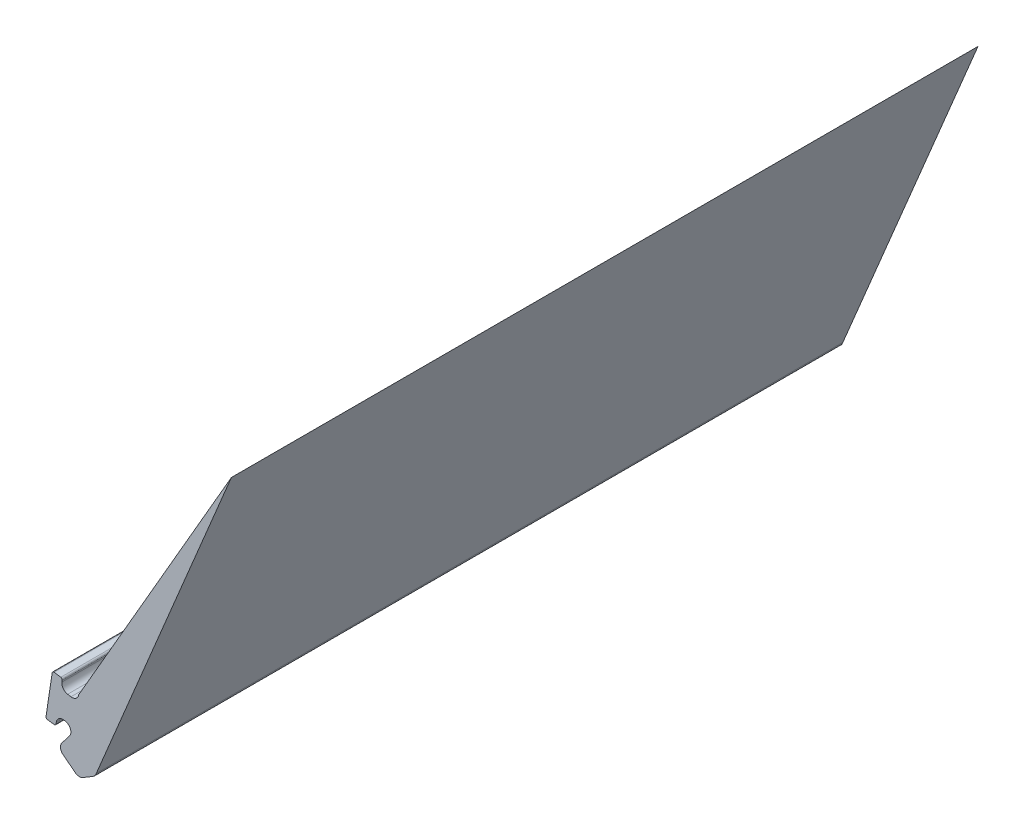
ISO-10303-21;
HEADER;
FILE_DESCRIPTION(('STEP AP214'),'2;1');
FILE_NAME('part.step','',(''),(''),'','','');
FILE_SCHEMA(('AUTOMOTIVE_DESIGN { 1 0 10303 214 1 1 1 1 }'));
ENDSEC;
DATA;
#1=APPLICATION_CONTEXT('core data for automotive mechanical design processes');
#2=APPLICATION_PROTOCOL_DEFINITION('international standard','automotive_design',2000,#1);
#3=PRODUCT_CONTEXT('',#1,'mechanical');
#4=PRODUCT('Part','Part','',(#3));
#5=PRODUCT_RELATED_PRODUCT_CATEGORY('part','',(#4));
#6=PRODUCT_DEFINITION_FORMATION('','',#4);
#7=PRODUCT_DEFINITION_CONTEXT('part definition',#1,'design');
#8=PRODUCT_DEFINITION('design','',#6,#7);
#9=PRODUCT_DEFINITION_SHAPE('','',#8);
#10=(LENGTH_UNIT() NAMED_UNIT(*) SI_UNIT(.MILLI.,.METRE.));
#11=(NAMED_UNIT(*) PLANE_ANGLE_UNIT() SI_UNIT($,.RADIAN.));
#12=(NAMED_UNIT(*) SI_UNIT($,.STERADIAN.) SOLID_ANGLE_UNIT());
#13=UNCERTAINTY_MEASURE_WITH_UNIT(LENGTH_MEASURE(1.E-05),#10,'distance_accuracy_value','');
#14=(GEOMETRIC_REPRESENTATION_CONTEXT(3) GLOBAL_UNCERTAINTY_ASSIGNED_CONTEXT((#13)) GLOBAL_UNIT_ASSIGNED_CONTEXT((#10,
#11,#12)) REPRESENTATION_CONTEXT('',''));
#15=CARTESIAN_POINT('',(0.,0.,0.));
#16=DIRECTION('',(0.,0.,1.));
#17=DIRECTION('',(1.,0.,0.));
#18=AXIS2_PLACEMENT_3D('',#15,#16,#17);
#19=CARTESIAN_POINT('',(-22.585447148469,11.7939049154633,-22.));
#20=DIRECTION('',(0.,0.,1.));
#21=DIRECTION('',(1.,0.,0.));
#22=AXIS2_PLACEMENT_3D('',#19,#20,#21);
#23=CYLINDRICAL_SURFACE('',#22,0.0499999999999998);
#24=CARTESIAN_POINT('',(-22.585447148469,11.7939049154633,0.));
#25=DIRECTION('',(0.,0.,1.));
#26=DIRECTION('',(1.,0.,0.));
#27=AXIS2_PLACEMENT_3D('',#24,#25,#26);
#28=CIRCLE('',#27,0.0499999999999998);
#29=CARTESIAN_POINT('',(-22.5924461977511,11.7443972058703,0.));
#30=VERTEX_POINT('',#29);
#31=CARTESIAN_POINT('',(-22.535939438876,11.7869058661812,0.));
#32=VERTEX_POINT('',#31);
#33=EDGE_CURVE('E220',#30,#32,#28,.T.);
#34=ORIENTED_EDGE('',*,*,#33,.F.);
#35=DIRECTION('',(0.,0.,1.));
#36=VECTOR('',#35,1.);
#37=CARTESIAN_POINT('',(-22.5924461977511,11.7443972058703,-22.));
#38=LINE('',#37,#36);
#39=CARTESIAN_POINT('',(-22.5924461977511,11.7443972058703,-22.));
#40=VERTEX_POINT('',#39);
#41=EDGE_CURVE('E11',#40,#30,#38,.T.);
#42=ORIENTED_EDGE('',*,*,#41,.F.);
#43=CARTESIAN_POINT('',(-22.585447148469,11.7939049154633,-22.));
#44=DIRECTION('',(0.,0.,1.));
#45=DIRECTION('',(1.,0.,0.));
#46=AXIS2_PLACEMENT_3D('',#43,#44,#45);
#47=CIRCLE('',#46,0.0499999999999998);
#48=CARTESIAN_POINT('',(-22.535939438876,11.7869058661812,-22.));
#49=VERTEX_POINT('',#48);
#50=EDGE_CURVE('E285',#40,#49,#47,.T.);
#51=ORIENTED_EDGE('',*,*,#50,.T.);
#52=DIRECTION('',(0.,0.,1.));
#53=VECTOR('',#52,1.);
#54=CARTESIAN_POINT('',(-22.535939438876,11.7869058661812,-22.));
#55=LINE('',#54,#53);
#56=EDGE_CURVE('E36',#49,#32,#55,.T.);
#57=ORIENTED_EDGE('',*,*,#56,.T.);
#58=EDGE_LOOP('',(#34,#42,#51,#57));
#59=FACE_BOUND('',#58,.T.);
#60=ADVANCED_FACE('F33',(#59),#23,.T.);
#61=CARTESIAN_POINT('',(-22.7896096187185,11.7722707736704,-22.));
#62=DIRECTION('',(-0.139980985641221,-0.990154191860496,0.));
#63=DIRECTION('',(0.990154191860496,-0.139980985641221,0.));
#64=AXIS2_PLACEMENT_3D('',#61,#62,#63);
#65=PLANE('',#64);
#66=DIRECTION('',(0.990154191860496,-0.139980985641221,0.));
#67=VECTOR('',#66,1.);
#68=CARTESIAN_POINT('',(-22.7896096187185,11.7722707736704,0.));
#69=LINE('',#68,#67);
#70=CARTESIAN_POINT('',(-22.7896096187185,11.7722707736704,0.));
#71=VERTEX_POINT('',#70);
#72=EDGE_CURVE('E283',#71,#30,#69,.T.);
#73=ORIENTED_EDGE('',*,*,#72,.F.);
#74=DIRECTION('',(0.,0.,1.));
#75=VECTOR('',#74,1.);
#76=CARTESIAN_POINT('',(-22.7896096187185,11.7722707736704,-22.));
#77=LINE('',#76,#75);
#78=CARTESIAN_POINT('',(-22.7896096187185,11.7722707736704,-22.));
#79=VERTEX_POINT('',#78);
#80=EDGE_CURVE('E42',#79,#71,#77,.T.);
#81=ORIENTED_EDGE('',*,*,#80,.F.);
#82=DIRECTION('',(0.990154191860496,-0.139980985641221,0.));
#83=VECTOR('',#82,1.);
#84=CARTESIAN_POINT('',(-22.7896096187185,11.7722707736704,-22.));
#85=LINE('',#84,#83);
#86=EDGE_CURVE('E210',#79,#40,#85,.T.);
#87=ORIENTED_EDGE('',*,*,#86,.T.);
#88=ORIENTED_EDGE('',*,*,#41,.T.);
#89=EDGE_LOOP('',(#73,#81,#87,#88));
#90=FACE_BOUND('',#89,.T.);
#91=ADVANCED_FACE('F327',(#90),#65,.T.);
#92=CARTESIAN_POINT('',(-22.7826105694364,11.8217784832634,-22.));
#93=DIRECTION('',(0.,0.,1.));
#94=DIRECTION('',(1.,0.,0.));
#95=AXIS2_PLACEMENT_3D('',#92,#93,#94);
#96=CYLINDRICAL_SURFACE('',#95,0.0499999999999991);
#97=CARTESIAN_POINT('',(-22.7826105694364,11.8217784832634,0.));
#98=DIRECTION('',(0.,0.,1.));
#99=DIRECTION('',(1.,0.,0.));
#100=AXIS2_PLACEMENT_3D('',#97,#98,#99);
#101=CIRCLE('',#100,0.0499999999999991);
#102=CARTESIAN_POINT('',(-22.8320520039546,11.8292313050634,0.));
#103=VERTEX_POINT('',#102);
#104=EDGE_CURVE('E197',#103,#71,#101,.T.);
#105=ORIENTED_EDGE('',*,*,#104,.F.);
#106=DIRECTION('',(0.,0.,1.));
#107=VECTOR('',#106,1.);
#108=CARTESIAN_POINT('',(-22.8320520039546,11.8292313050634,-22.));
#109=LINE('',#108,#107);
#110=CARTESIAN_POINT('',(-22.8320520039546,11.8292313050634,-22.));
#111=VERTEX_POINT('',#110);
#112=EDGE_CURVE('E192',#111,#103,#109,.T.);
#113=ORIENTED_EDGE('',*,*,#112,.F.);
#114=CARTESIAN_POINT('',(-22.7826105694364,11.8217784832634,-22.));
#115=DIRECTION('',(0.,0.,1.));
#116=DIRECTION('',(1.,0.,0.));
#117=AXIS2_PLACEMENT_3D('',#114,#115,#116);
#118=CIRCLE('',#117,0.0499999999999991);
#119=EDGE_CURVE('E195',#111,#79,#118,.T.);
#120=ORIENTED_EDGE('',*,*,#119,.T.);
#121=ORIENTED_EDGE('',*,*,#80,.T.);
#122=EDGE_LOOP('',(#105,#113,#120,#121));
#123=FACE_BOUND('',#122,.T.);
#124=ADVANCED_FACE('F194',(#123),#96,.T.);
#125=CARTESIAN_POINT('',(-22.649856553881,13.0379016122493,-22.));
#126=DIRECTION('',(-0.98882869036419,0.149056435998724,0.));
#127=DIRECTION('',(-0.149056435998724,-0.98882869036419,0.));
#128=AXIS2_PLACEMENT_3D('',#125,#126,#127);
#129=PLANE('',#128);
#130=DIRECTION('',(-0.149056435998724,-0.98882869036419,0.));
#131=VECTOR('',#130,1.);
#132=CARTESIAN_POINT('',(-22.649856553881,13.0379016122493,0.));
#133=LINE('',#132,#131);
#134=CARTESIAN_POINT('',(-22.649856553881,13.0379016122493,0.));
#135=VERTEX_POINT('',#134);
#136=EDGE_CURVE('E280',#135,#103,#133,.T.);
#137=ORIENTED_EDGE('',*,*,#136,.F.);
#138=DIRECTION('',(0.,0.,1.));
#139=VECTOR('',#138,1.);
#140=CARTESIAN_POINT('',(-22.649856553881,13.0379016122493,-22.));
#141=LINE('',#140,#139);
#142=CARTESIAN_POINT('',(-22.649856553881,13.0379016122493,-22.));
#143=VERTEX_POINT('',#142);
#144=EDGE_CURVE('E202',#143,#135,#141,.T.);
#145=ORIENTED_EDGE('',*,*,#144,.F.);
#146=DIRECTION('',(-0.149056435998724,-0.98882869036419,0.));
#147=VECTOR('',#146,1.);
#148=CARTESIAN_POINT('',(-22.649856553881,13.0379016122493,-22.));
#149=LINE('',#148,#147);
#150=EDGE_CURVE('E208',#143,#111,#149,.T.);
#151=ORIENTED_EDGE('',*,*,#150,.T.);
#152=ORIENTED_EDGE('',*,*,#112,.T.);
#153=EDGE_LOOP('',(#137,#145,#151,#152));
#154=FACE_BOUND('',#153,.T.);
#155=ADVANCED_FACE('F212',(#154),#129,.T.);
#156=CARTESIAN_POINT('',(-22.6004151193628,13.0304487904494,-22.));
#157=DIRECTION('',(0.,0.,1.));
#158=DIRECTION('',(1.,0.,0.));
#159=AXIS2_PLACEMENT_3D('',#156,#157,#158);
#160=CYLINDRICAL_SURFACE('',#159,0.0500000000000009);
#161=CARTESIAN_POINT('',(-22.6004151193628,13.0304487904494,0.));
#162=DIRECTION('',(0.,0.,1.));
#163=DIRECTION('',(1.,0.,0.));
#164=AXIS2_PLACEMENT_3D('',#161,#162,#163);
#165=CIRCLE('',#164,0.0500000000000009);
#166=CARTESIAN_POINT('',(-22.5929622975628,13.0798902249676,0.));
#167=VERTEX_POINT('',#166);
#168=EDGE_CURVE('E277',#167,#135,#165,.T.);
#169=ORIENTED_EDGE('',*,*,#168,.F.);
#170=DIRECTION('',(0.,0.,1.));
#171=VECTOR('',#170,1.);
#172=CARTESIAN_POINT('',(-22.5929622975628,13.0798902249676,-22.));
#173=LINE('',#172,#171);
#174=CARTESIAN_POINT('',(-22.5929622975628,13.0798902249676,-22.));
#175=VERTEX_POINT('',#174);
#176=EDGE_CURVE('E289',#175,#167,#173,.T.);
#177=ORIENTED_EDGE('',*,*,#176,.F.);
#178=CARTESIAN_POINT('',(-22.6004151193628,13.0304487904494,-22.));
#179=DIRECTION('',(0.,0.,1.));
#180=DIRECTION('',(1.,0.,0.));
#181=AXIS2_PLACEMENT_3D('',#178,#179,#180);
#182=CIRCLE('',#181,0.0500000000000009);
#183=EDGE_CURVE('E213',#175,#143,#182,.T.);
#184=ORIENTED_EDGE('',*,*,#183,.T.);
#185=ORIENTED_EDGE('',*,*,#144,.T.);
#186=EDGE_LOOP('',(#169,#177,#184,#185));
#187=FACE_BOUND('',#186,.T.);
#188=ADVANCED_FACE('F340',(#187),#160,.T.);
#189=CARTESIAN_POINT('',(-22.3966145863261,13.0502926917056,-22.));
#190=DIRECTION('',(0.149056435998733,0.988828690364188,0.));
#191=DIRECTION('',(-0.988828690364188,0.149056435998733,0.));
#192=AXIS2_PLACEMENT_3D('',#189,#190,#191);
#193=PLANE('',#192);
#194=DIRECTION('',(-0.988828690364188,0.149056435998733,0.));
#195=VECTOR('',#194,1.);
#196=CARTESIAN_POINT('',(-22.3966145863261,13.0502926917056,0.));
#197=LINE('',#196,#195);
#198=CARTESIAN_POINT('',(-22.3966145863261,13.0502926917056,0.));
#199=VERTEX_POINT('',#198);
#200=EDGE_CURVE('E274',#199,#167,#197,.T.);
#201=ORIENTED_EDGE('',*,*,#200,.F.);
#202=DIRECTION('',(0.,0.,1.));
#203=VECTOR('',#202,1.);
#204=CARTESIAN_POINT('',(-22.3966145863261,13.0502926917056,-22.));
#205=LINE('',#204,#203);
#206=CARTESIAN_POINT('',(-22.3966145863261,13.0502926917056,-22.));
#207=VERTEX_POINT('',#206);
#208=EDGE_CURVE('E291',#207,#199,#205,.T.);
#209=ORIENTED_EDGE('',*,*,#208,.F.);
#210=DIRECTION('',(-0.988828690364188,0.149056435998733,0.));
#211=VECTOR('',#210,1.);
#212=CARTESIAN_POINT('',(-22.3966145863261,13.0502926917056,-22.));
#213=LINE('',#212,#211);
#214=EDGE_CURVE('E215',#207,#175,#213,.T.);
#215=ORIENTED_EDGE('',*,*,#214,.T.);
#216=ORIENTED_EDGE('',*,*,#176,.T.);
#217=EDGE_LOOP('',(#201,#209,#215,#216));
#218=FACE_BOUND('',#217,.T.);
#219=ADVANCED_FACE('F343',(#218),#193,.T.);
#220=CARTESIAN_POINT('',(-22.4040674081261,13.0008512571874,-22.));
#221=DIRECTION('',(0.,0.,1.));
#222=DIRECTION('',(1.,0.,0.));
#223=AXIS2_PLACEMENT_3D('',#220,#221,#222);
#224=CYLINDRICAL_SURFACE('',#223,0.0499999999999985);
#225=CARTESIAN_POINT('',(-22.4040674081261,13.0008512571874,0.));
#226=DIRECTION('',(0.,0.,1.));
#227=DIRECTION('',(1.,0.,0.));
#228=AXIS2_PLACEMENT_3D('',#225,#226,#227);
#229=CIRCLE('',#228,0.0499999999999985);
#230=CARTESIAN_POINT('',(-22.3546871012229,12.9930036275992,0.));
#231=VERTEX_POINT('',#230);
#232=EDGE_CURVE('E271',#231,#199,#229,.T.);
#233=ORIENTED_EDGE('',*,*,#232,.F.);
#234=DIRECTION('',(0.,0.,1.));
#235=VECTOR('',#234,1.);
#236=CARTESIAN_POINT('',(-22.3546871012229,12.9930036275992,-22.));
#237=LINE('',#236,#235);
#238=CARTESIAN_POINT('',(-22.3546871012229,12.9930036275992,-22.));
#239=VERTEX_POINT('',#238);
#240=EDGE_CURVE('E293',#239,#231,#237,.T.);
#241=ORIENTED_EDGE('',*,*,#240,.F.);
#242=CARTESIAN_POINT('',(-22.4040674081261,13.0008512571874,-22.));
#243=DIRECTION('',(0.,0.,1.));
#244=DIRECTION('',(1.,0.,0.));
#245=AXIS2_PLACEMENT_3D('',#242,#243,#244);
#246=CIRCLE('',#245,0.0499999999999985);
#247=EDGE_CURVE('E623',#239,#207,#246,.T.);
#248=ORIENTED_EDGE('',*,*,#247,.T.);
#249=ORIENTED_EDGE('',*,*,#208,.T.);
#250=EDGE_LOOP('',(#233,#241,#248,#249));
#251=FACE_BOUND('',#250,.T.);
#252=ADVANCED_FACE('F347',(#251),#224,.T.);
#253=CARTESIAN_POINT('',(-22.3623458614109,12.9448117596817,-22.));
#254=DIRECTION('',(0.987606138062437,-0.156952591763878,0.));
#255=DIRECTION('',(0.156952591763878,0.987606138062437,0.));
#256=AXIS2_PLACEMENT_3D('',#253,#254,#255);
#257=PLANE('',#256);
#258=DIRECTION('',(0.156952591763878,0.987606138062437,0.));
#259=VECTOR('',#258,1.);
#260=CARTESIAN_POINT('',(-22.3623458614109,12.9448117596817,0.));
#261=LINE('',#260,#259);
#262=CARTESIAN_POINT('',(-22.3623458614109,12.9448117596817,0.));
#263=VERTEX_POINT('',#262);
#264=EDGE_CURVE('E268',#263,#231,#261,.T.);
#265=ORIENTED_EDGE('',*,*,#264,.F.);
#266=DIRECTION('',(0.,0.,1.));
#267=VECTOR('',#266,1.);
#268=CARTESIAN_POINT('',(-22.3623458614109,12.9448117596817,-22.));
#269=LINE('',#268,#267);
#270=CARTESIAN_POINT('',(-22.3623458614109,12.9448117596817,-22.));
#271=VERTEX_POINT('',#270);
#272=EDGE_CURVE('E295',#271,#263,#269,.T.);
#273=ORIENTED_EDGE('',*,*,#272,.F.);
#274=DIRECTION('',(0.156952591763878,0.987606138062437,0.));
#275=VECTOR('',#274,1.);
#276=CARTESIAN_POINT('',(-22.3623458614109,12.9448117596817,-22.));
#277=LINE('',#276,#275);
#278=EDGE_CURVE('E616',#271,#239,#277,.T.);
#279=ORIENTED_EDGE('',*,*,#278,.T.);
#280=ORIENTED_EDGE('',*,*,#240,.T.);
#281=EDGE_LOOP('',(#265,#273,#279,#280));
#282=FACE_BOUND('',#281,.T.);
#283=ADVANCED_FACE('F351',(#282),#257,.T.);
#284=CARTESIAN_POINT('',(-22.1648246337984,12.9134212413289,-22.));
#285=DIRECTION('',(0.,0.,1.));
#286=DIRECTION('',(1.,0.,0.));
#287=AXIS2_PLACEMENT_3D('',#284,#285,#286);
#288=CYLINDRICAL_SURFACE('',#287,0.2);
#289=CARTESIAN_POINT('',(-22.1648246337984,12.9134212413289,0.));
#290=DIRECTION('',(0.,0.,-1.));
#291=DIRECTION('',(-1.,0.,0.));
#292=AXIS2_PLACEMENT_3D('',#289,#290,#291);
#293=CIRCLE('',#292,0.2);
#294=CARTESIAN_POINT('',(-22.1962151521512,12.7159000137164,0.));
#295=VERTEX_POINT('',#294);
#296=EDGE_CURVE('E265',#295,#263,#293,.T.);
#297=ORIENTED_EDGE('',*,*,#296,.F.);
#298=DIRECTION('',(0.,0.,1.));
#299=VECTOR('',#298,1.);
#300=CARTESIAN_POINT('',(-22.1962151521512,12.7159000137164,-22.));
#301=LINE('',#300,#299);
#302=CARTESIAN_POINT('',(-22.1962151521512,12.7159000137164,-22.));
#303=VERTEX_POINT('',#302);
#304=EDGE_CURVE('E297',#303,#295,#301,.T.);
#305=ORIENTED_EDGE('',*,*,#304,.F.);
#306=CARTESIAN_POINT('',(-22.1648246337984,12.9134212413289,-22.));
#307=DIRECTION('',(0.,0.,-1.));
#308=DIRECTION('',(-1.,0.,0.));
#309=AXIS2_PLACEMENT_3D('',#306,#307,#308);
#310=CIRCLE('',#309,0.2);
#311=EDGE_CURVE('E612',#303,#271,#310,.T.);
#312=ORIENTED_EDGE('',*,*,#311,.T.);
#313=ORIENTED_EDGE('',*,*,#272,.T.);
#314=EDGE_LOOP('',(#297,#305,#312,#313));
#315=FACE_BOUND('',#314,.T.);
#316=ADVANCED_FACE('F355',(#315),#288,.F.);
#317=CARTESIAN_POINT('',(-22.097868543895,12.7002705492344,-22.));
#318=DIRECTION('',(0.156952591763935,0.987606138062428,0.));
#319=DIRECTION('',(-0.987606138062428,0.156952591763935,0.));
#320=AXIS2_PLACEMENT_3D('',#317,#318,#319);
#321=PLANE('',#320);
#322=DIRECTION('',(-0.987606138062428,0.156952591763935,0.));
#323=VECTOR('',#322,1.);
#324=CARTESIAN_POINT('',(-22.097868543895,12.7002705492344,0.));
#325=LINE('',#324,#323);
#326=CARTESIAN_POINT('',(-22.097868543895,12.7002705492344,0.));
#327=VERTEX_POINT('',#326);
#328=EDGE_CURVE('E262',#327,#295,#325,.T.);
#329=ORIENTED_EDGE('',*,*,#328,.F.);
#330=DIRECTION('',(0.,0.,1.));
#331=VECTOR('',#330,1.);
#332=CARTESIAN_POINT('',(-22.097868543895,12.7002705492344,-22.));
#333=LINE('',#332,#331);
#334=CARTESIAN_POINT('',(-22.097868543895,12.7002705492344,-22.));
#335=VERTEX_POINT('',#334);
#336=EDGE_CURVE('E299',#335,#327,#333,.T.);
#337=ORIENTED_EDGE('',*,*,#336,.F.);
#338=DIRECTION('',(-0.987606138062428,0.156952591763935,0.));
#339=VECTOR('',#338,1.);
#340=CARTESIAN_POINT('',(-22.097868543895,12.7002705492344,-22.));
#341=LINE('',#340,#339);
#342=EDGE_CURVE('E628',#335,#303,#341,.T.);
#343=ORIENTED_EDGE('',*,*,#342,.T.);
#344=ORIENTED_EDGE('',*,*,#304,.T.);
#345=EDGE_LOOP('',(#329,#337,#343,#344));
#346=FACE_BOUND('',#345,.T.);
#347=ADVANCED_FACE('F359',(#346),#321,.T.);
#348=CARTESIAN_POINT('',(-22.0664780255422,12.8977917768469,-22.));
#349=DIRECTION('',(0.,0.,1.));
#350=DIRECTION('',(1.,0.,0.));
#351=AXIS2_PLACEMENT_3D('',#348,#349,#350);
#352=CYLINDRICAL_SURFACE('',#351,0.199999999999998);
#353=CARTESIAN_POINT('',(-22.0664780255422,12.8977917768469,0.));
#354=DIRECTION('',(0.,0.,-1.));
#355=DIRECTION('',(-1.,0.,0.));
#356=AXIS2_PLACEMENT_3D('',#353,#354,#355);
#357=CIRCLE('',#356,0.199999999999998);
#358=CARTESIAN_POINT('',(-21.8688272126065,12.867227808749,0.));
#359=VERTEX_POINT('',#358);
#360=EDGE_CURVE('E259',#359,#327,#357,.T.);
#361=ORIENTED_EDGE('',*,*,#360,.F.);
#362=DIRECTION('',(0.,0.,1.));
#363=VECTOR('',#362,1.);
#364=CARTESIAN_POINT('',(-21.8688272126065,12.867227808749,-22.));
#365=LINE('',#364,#363);
#366=CARTESIAN_POINT('',(-21.8688272126065,12.867227808749,-22.));
#367=VERTEX_POINT('',#366);
#368=EDGE_CURVE('E301',#367,#359,#365,.T.);
#369=ORIENTED_EDGE('',*,*,#368,.F.);
#370=CARTESIAN_POINT('',(-22.0664780255422,12.8977917768469,-22.));
#371=DIRECTION('',(0.,0.,-1.));
#372=DIRECTION('',(-1.,0.,0.));
#373=AXIS2_PLACEMENT_3D('',#370,#371,#372);
#374=CIRCLE('',#373,0.199999999999998);
#375=EDGE_CURVE('E605',#367,#335,#374,.T.);
#376=ORIENTED_EDGE('',*,*,#375,.T.);
#377=ORIENTED_EDGE('',*,*,#336,.T.);
#378=EDGE_LOOP('',(#361,#369,#376,#377));
#379=FACE_BOUND('',#378,.T.);
#380=ADVANCED_FACE('F363',(#379),#352,.F.);
#381=CARTESIAN_POINT('',(-17.3688272126065,20.661456442809,-22.));
#382=DIRECTION('',(-0.866025403784436,0.500000000000005,0.));
#383=DIRECTION('',(-0.500000000000005,-0.866025403784436,0.));
#384=AXIS2_PLACEMENT_3D('',#381,#382,#383);
#385=PLANE('',#384);
#386=DIRECTION('',(-0.500000000000005,-0.866025403784436,0.));
#387=VECTOR('',#386,1.);
#388=CARTESIAN_POINT('',(-17.3688272126065,20.661456442809,0.));
#389=LINE('',#388,#387);
#390=CARTESIAN_POINT('',(-17.3688272126065,20.661456442809,0.));
#391=VERTEX_POINT('',#390);
#392=EDGE_CURVE('E256',#391,#359,#389,.T.);
#393=ORIENTED_EDGE('',*,*,#392,.F.);
#394=DIRECTION('',(0.,0.,1.));
#395=VECTOR('',#394,1.);
#396=CARTESIAN_POINT('',(-17.3688272126065,20.661456442809,-22.));
#397=LINE('',#396,#395);
#398=CARTESIAN_POINT('',(-17.3688272126065,20.661456442809,-22.));
#399=VERTEX_POINT('',#398);
#400=EDGE_CURVE('E303',#399,#391,#397,.T.);
#401=ORIENTED_EDGE('',*,*,#400,.F.);
#402=DIRECTION('',(-0.500000000000005,-0.866025403784436,0.));
#403=VECTOR('',#402,1.);
#404=CARTESIAN_POINT('',(-17.3688272126065,20.661456442809,-22.));
#405=LINE('',#404,#403);
#406=EDGE_CURVE('E601',#399,#367,#405,.T.);
#407=ORIENTED_EDGE('',*,*,#406,.T.);
#408=ORIENTED_EDGE('',*,*,#368,.T.);
#409=EDGE_LOOP('',(#393,#401,#407,#408));
#410=FACE_BOUND('',#409,.T.);
#411=ADVANCED_FACE('F367',(#410),#385,.T.);
#412=CARTESIAN_POINT('',(-21.352059249591,11.115481200223,-22.));
#413=DIRECTION('',(0.92287970524711,-0.385088366018771,0.));
#414=DIRECTION('',(0.385088366018771,0.92287970524711,0.));
#415=AXIS2_PLACEMENT_3D('',#412,#413,#414);
#416=PLANE('',#415);
#417=DIRECTION('',(0.385088366018771,0.92287970524711,0.));
#418=VECTOR('',#417,1.);
#419=CARTESIAN_POINT('',(-21.352059249591,11.115481200223,0.));
#420=LINE('',#419,#418);
#421=CARTESIAN_POINT('',(-21.352059249591,11.115481200223,0.));
#422=VERTEX_POINT('',#421);
#423=EDGE_CURVE('E253',#422,#391,#420,.T.);
#424=ORIENTED_EDGE('',*,*,#423,.F.);
#425=DIRECTION('',(0.,0.,1.));
#426=VECTOR('',#425,1.);
#427=CARTESIAN_POINT('',(-21.352059249591,11.115481200223,-22.));
#428=LINE('',#427,#426);
#429=CARTESIAN_POINT('',(-21.352059249591,11.115481200223,-22.));
#430=VERTEX_POINT('',#429);
#431=EDGE_CURVE('E305',#430,#422,#428,.T.);
#432=ORIENTED_EDGE('',*,*,#431,.F.);
#433=DIRECTION('',(0.385088366018771,0.92287970524711,0.));
#434=VECTOR('',#433,1.);
#435=CARTESIAN_POINT('',(-21.352059249591,11.115481200223,-22.));
#436=LINE('',#435,#434);
#437=EDGE_CURVE('E632',#430,#399,#436,.T.);
#438=ORIENTED_EDGE('',*,*,#437,.T.);
#439=ORIENTED_EDGE('',*,*,#400,.T.);
#440=EDGE_LOOP('',(#424,#432,#438,#439));
#441=FACE_BOUND('',#440,.T.);
#442=ADVANCED_FACE('F371',(#441),#416,.T.);
#443=CARTESIAN_POINT('',(-21.5447734014282,11.1689719067212,-22.));
#444=DIRECTION('',(0.,0.,1.));
#445=DIRECTION('',(1.,0.,0.));
#446=AXIS2_PLACEMENT_3D('',#443,#444,#445);
#447=CYLINDRICAL_SURFACE('',#446,0.2);
#448=CARTESIAN_POINT('',(-21.5447734014282,11.1689719067212,0.));
#449=DIRECTION('',(0.,0.,1.));
#450=DIRECTION('',(1.,0.,0.));
#451=AXIS2_PLACEMENT_3D('',#448,#449,#450);
#452=CIRCLE('',#451,0.2);
#453=CARTESIAN_POINT('',(-21.4415016973595,10.9976974044193,0.));
#454=VERTEX_POINT('',#453);
#455=EDGE_CURVE('E250',#454,#422,#452,.T.);
#456=ORIENTED_EDGE('',*,*,#455,.F.);
#457=DIRECTION('',(0.,0.,1.));
#458=VECTOR('',#457,1.);
#459=CARTESIAN_POINT('',(-21.4415016973595,10.9976974044193,-22.));
#460=LINE('',#459,#458);
#461=CARTESIAN_POINT('',(-21.4415016973595,10.9976974044193,-22.));
#462=VERTEX_POINT('',#461);
#463=EDGE_CURVE('E307',#462,#454,#460,.T.);
#464=ORIENTED_EDGE('',*,*,#463,.F.);
#465=CARTESIAN_POINT('',(-21.5447734014282,11.1689719067212,-22.));
#466=DIRECTION('',(0.,0.,1.));
#467=DIRECTION('',(1.,0.,0.));
#468=AXIS2_PLACEMENT_3D('',#465,#466,#467);
#469=CIRCLE('',#468,0.2);
#470=EDGE_CURVE('E594',#462,#430,#469,.T.);
#471=ORIENTED_EDGE('',*,*,#470,.T.);
#472=ORIENTED_EDGE('',*,*,#431,.T.);
#473=EDGE_LOOP('',(#456,#464,#471,#472));
#474=FACE_BOUND('',#473,.T.);
#475=ADVANCED_FACE('F375',(#474),#447,.T.);
#476=CARTESIAN_POINT('',(-21.7439520767196,10.8153318704201,-22.));
#477=DIRECTION('',(0.516358520343292,-0.856372511509382,0.));
#478=DIRECTION('',(0.856372511509382,0.516358520343292,0.));
#479=AXIS2_PLACEMENT_3D('',#476,#477,#478);
#480=PLANE('',#479);
#481=DIRECTION('',(0.856372511509382,0.516358520343292,0.));
#482=VECTOR('',#481,1.);
#483=CARTESIAN_POINT('',(-21.7439520767196,10.8153318704201,0.));
#484=LINE('',#483,#482);
#485=CARTESIAN_POINT('',(-21.7439520767196,10.8153318704201,0.));
#486=VERTEX_POINT('',#485);
#487=EDGE_CURVE('E247',#486,#454,#484,.T.);
#488=ORIENTED_EDGE('',*,*,#487,.F.);
#489=DIRECTION('',(0.,0.,1.));
#490=VECTOR('',#489,1.);
#491=CARTESIAN_POINT('',(-21.7439520767196,10.8153318704201,-22.));
#492=LINE('',#491,#490);
#493=CARTESIAN_POINT('',(-21.7439520767196,10.8153318704201,-22.));
#494=VERTEX_POINT('',#493);
#495=EDGE_CURVE('E309',#494,#486,#492,.T.);
#496=ORIENTED_EDGE('',*,*,#495,.F.);
#497=DIRECTION('',(0.856372511509382,0.516358520343292,0.));
#498=VECTOR('',#497,1.);
#499=CARTESIAN_POINT('',(-21.7439520767196,10.8153318704201,-22.));
#500=LINE('',#499,#498);
#501=EDGE_CURVE('E590',#494,#462,#500,.T.);
#502=ORIENTED_EDGE('',*,*,#501,.T.);
#503=ORIENTED_EDGE('',*,*,#463,.T.);
#504=EDGE_LOOP('',(#488,#496,#502,#503));
#505=FACE_BOUND('',#504,.T.);
#506=ADVANCED_FACE('F379',(#505),#480,.T.);
#507=CARTESIAN_POINT('',(-21.8472237807883,10.9866063727219,-22.));
#508=DIRECTION('',(0.,0.,1.));
#509=DIRECTION('',(1.,0.,0.));
#510=AXIS2_PLACEMENT_3D('',#507,#508,#509);
#511=CYLINDRICAL_SURFACE('',#510,0.199999999999999);
#512=CARTESIAN_POINT('',(-21.8472237807883,10.9866063727219,0.));
#513=DIRECTION('',(0.,0.,1.));
#514=DIRECTION('',(1.,0.,0.));
#515=AXIS2_PLACEMENT_3D('',#512,#513,#514);
#516=CIRCLE('',#515,0.199999999999999);
#517=CARTESIAN_POINT('',(-21.9694724992268,10.8283178676429,0.));
#518=VERTEX_POINT('',#517);
#519=EDGE_CURVE('E244',#518,#486,#516,.T.);
#520=ORIENTED_EDGE('',*,*,#519,.F.);
#521=DIRECTION('',(0.,0.,1.));
#522=VECTOR('',#521,1.);
#523=CARTESIAN_POINT('',(-21.9694724992268,10.8283178676429,-22.));
#524=LINE('',#523,#522);
#525=CARTESIAN_POINT('',(-21.9694724992268,10.8283178676429,-22.));
#526=VERTEX_POINT('',#525);
#527=EDGE_CURVE('E311',#526,#518,#524,.T.);
#528=ORIENTED_EDGE('',*,*,#527,.F.);
#529=CARTESIAN_POINT('',(-21.8472237807883,10.9866063727219,-22.));
#530=DIRECTION('',(0.,0.,1.));
#531=DIRECTION('',(1.,0.,0.));
#532=AXIS2_PLACEMENT_3D('',#529,#530,#531);
#533=CIRCLE('',#532,0.199999999999999);
#534=EDGE_CURVE('E636',#526,#494,#533,.T.);
#535=ORIENTED_EDGE('',*,*,#534,.T.);
#536=ORIENTED_EDGE('',*,*,#495,.T.);
#537=EDGE_LOOP('',(#520,#528,#535,#536));
#538=FACE_BOUND('',#537,.T.);
#539=ADVANCED_FACE('F383',(#538),#511,.T.);
#540=CARTESIAN_POINT('',(-22.3294124318725,11.1063051760632,-22.));
#541=DIRECTION('',(-0.611243592192459,-0.791442525395028,0.));
#542=DIRECTION('',(0.791442525395028,-0.611243592192459,0.));
#543=AXIS2_PLACEMENT_3D('',#540,#541,#542);
#544=PLANE('',#543);
#545=DIRECTION('',(0.791442525395028,-0.611243592192459,0.));
#546=VECTOR('',#545,1.);
#547=CARTESIAN_POINT('',(-22.3294124318725,11.1063051760632,0.));
#548=LINE('',#547,#546);
#549=CARTESIAN_POINT('',(-22.3294124318725,11.1063051760632,0.));
#550=VERTEX_POINT('',#549);
#551=EDGE_CURVE('E241',#550,#518,#548,.T.);
#552=ORIENTED_EDGE('',*,*,#551,.F.);
#553=DIRECTION('',(0.,0.,1.));
#554=VECTOR('',#553,1.);
#555=CARTESIAN_POINT('',(-22.3294124318725,11.1063051760632,-22.));
#556=LINE('',#555,#554);
#557=CARTESIAN_POINT('',(-22.3294124318725,11.1063051760632,-22.));
#558=VERTEX_POINT('',#557);
#559=EDGE_CURVE('E313',#558,#550,#556,.T.);
#560=ORIENTED_EDGE('',*,*,#559,.F.);
#561=DIRECTION('',(0.791442525395028,-0.611243592192459,0.));
#562=VECTOR('',#561,1.);
#563=CARTESIAN_POINT('',(-22.3294124318725,11.1063051760632,-22.));
#564=LINE('',#563,#562);
#565=EDGE_CURVE('E583',#558,#526,#564,.T.);
#566=ORIENTED_EDGE('',*,*,#565,.T.);
#567=ORIENTED_EDGE('',*,*,#527,.T.);
#568=EDGE_LOOP('',(#552,#560,#566,#567));
#569=FACE_BOUND('',#568,.T.);
#570=ADVANCED_FACE('F387',(#569),#544,.T.);
#571=CARTESIAN_POINT('',(-22.207163713434,11.2645936811422,-22.));
#572=DIRECTION('',(0.,0.,1.));
#573=DIRECTION('',(1.,0.,0.));
#574=AXIS2_PLACEMENT_3D('',#571,#572,#573);
#575=CYLINDRICAL_SURFACE('',#574,0.2);
#576=CARTESIAN_POINT('',(-22.207163713434,11.2645936811422,0.));
#577=DIRECTION('',(0.,0.,1.));
#578=DIRECTION('',(1.,0.,0.));
#579=AXIS2_PLACEMENT_3D('',#576,#577,#578);
#580=CIRCLE('',#579,0.2);
#581=CARTESIAN_POINT('',(-22.365452218513,11.3868423995807,0.));
#582=VERTEX_POINT('',#581);
#583=EDGE_CURVE('E238',#582,#550,#580,.T.);
#584=ORIENTED_EDGE('',*,*,#583,.F.);
#585=DIRECTION('',(0.,0.,1.));
#586=VECTOR('',#585,1.);
#587=CARTESIAN_POINT('',(-22.365452218513,11.3868423995807,-22.));
#588=LINE('',#587,#586);
#589=CARTESIAN_POINT('',(-22.365452218513,11.3868423995807,-22.));
#590=VERTEX_POINT('',#589);
#591=EDGE_CURVE('E315',#590,#582,#588,.T.);
#592=ORIENTED_EDGE('',*,*,#591,.F.);
#593=CARTESIAN_POINT('',(-22.207163713434,11.2645936811422,-22.));
#594=DIRECTION('',(0.,0.,1.));
#595=DIRECTION('',(1.,0.,0.));
#596=AXIS2_PLACEMENT_3D('',#593,#594,#595);
#597=CIRCLE('',#596,0.2);
#598=EDGE_CURVE('E579',#590,#558,#597,.T.);
#599=ORIENTED_EDGE('',*,*,#598,.T.);
#600=ORIENTED_EDGE('',*,*,#559,.T.);
#601=EDGE_LOOP('',(#584,#592,#599,#600));
#602=FACE_BOUND('',#601,.T.);
#603=ADVANCED_FACE('F391',(#602),#575,.T.);
#604=CARTESIAN_POINT('',(-22.1419724377572,11.6762055999731,-22.));
#605=DIRECTION('',(-0.791442525395027,0.611243592192459,0.));
#606=DIRECTION('',(-0.611243592192459,-0.791442525395027,0.));
#607=AXIS2_PLACEMENT_3D('',#604,#605,#606);
#608=PLANE('',#607);
#609=DIRECTION('',(-0.611243592192459,-0.791442525395027,0.));
#610=VECTOR('',#609,1.);
#611=CARTESIAN_POINT('',(-22.1419724377572,11.6762055999731,0.));
#612=LINE('',#611,#610);
#613=CARTESIAN_POINT('',(-22.1419724377572,11.6762055999731,0.));
#614=VERTEX_POINT('',#613);
#615=EDGE_CURVE('E235',#614,#582,#612,.T.);
#616=ORIENTED_EDGE('',*,*,#615,.F.);
#617=DIRECTION('',(0.,0.,1.));
#618=VECTOR('',#617,1.);
#619=CARTESIAN_POINT('',(-22.1419724377572,11.6762055999731,-22.));
#620=LINE('',#619,#618);
#621=CARTESIAN_POINT('',(-22.1419724377572,11.6762055999731,-22.));
#622=VERTEX_POINT('',#621);
#623=EDGE_CURVE('E317',#622,#614,#620,.T.);
#624=ORIENTED_EDGE('',*,*,#623,.F.);
#625=DIRECTION('',(-0.611243592192459,-0.791442525395027,0.));
#626=VECTOR('',#625,1.);
#627=CARTESIAN_POINT('',(-22.1419724377572,11.6762055999731,-22.));
#628=LINE('',#627,#626);
#629=EDGE_CURVE('E640',#622,#590,#628,.T.);
#630=ORIENTED_EDGE('',*,*,#629,.T.);
#631=ORIENTED_EDGE('',*,*,#591,.T.);
#632=EDGE_LOOP('',(#616,#624,#630,#631));
#633=FACE_BOUND('',#632,.T.);
#634=ADVANCED_FACE('F395',(#633),#608,.T.);
#635=CARTESIAN_POINT('',(-22.3002609428362,11.7984543184116,-22.));
#636=DIRECTION('',(0.,0.,1.));
#637=DIRECTION('',(1.,0.,0.));
#638=AXIS2_PLACEMENT_3D('',#635,#636,#637);
#639=CYLINDRICAL_SURFACE('',#638,0.200000000000002);
#640=CARTESIAN_POINT('',(-22.3002609428362,11.7984543184116,0.));
#641=DIRECTION('',(0.,0.,-1.));
#642=DIRECTION('',(-1.,0.,0.));
#643=AXIS2_PLACEMENT_3D('',#640,#641,#642);
#644=CIRCLE('',#643,0.200000000000002);
#645=CARTESIAN_POINT('',(-22.264046695213,11.9951483149369,0.));
#646=VERTEX_POINT('',#645);
#647=EDGE_CURVE('E232',#646,#614,#644,.T.);
#648=ORIENTED_EDGE('',*,*,#647,.F.);
#649=DIRECTION('',(0.,0.,1.));
#650=VECTOR('',#649,1.);
#651=CARTESIAN_POINT('',(-22.264046695213,11.9951483149369,-22.));
#652=LINE('',#651,#650);
#653=CARTESIAN_POINT('',(-22.264046695213,11.9951483149369,-22.));
#654=VERTEX_POINT('',#653);
#655=EDGE_CURVE('E319',#654,#646,#652,.T.);
#656=ORIENTED_EDGE('',*,*,#655,.F.);
#657=CARTESIAN_POINT('',(-22.3002609428362,11.7984543184116,-22.));
#658=DIRECTION('',(0.,0.,-1.));
#659=DIRECTION('',(-1.,0.,0.));
#660=AXIS2_PLACEMENT_3D('',#657,#658,#659);
#661=CIRCLE('',#660,0.200000000000002);
#662=EDGE_CURVE('E572',#654,#622,#661,.T.);
#663=ORIENTED_EDGE('',*,*,#662,.T.);
#664=ORIENTED_EDGE('',*,*,#623,.T.);
#665=EDGE_LOOP('',(#648,#656,#663,#664));
#666=FACE_BOUND('',#665,.T.);
#667=ADVANCED_FACE('F399',(#666),#639,.F.);
#668=CARTESIAN_POINT('',(-22.2952905691235,12.0009007700524,-22.));
#669=DIRECTION('',(-0.181071238115871,-0.983469982626407,0.));
#670=DIRECTION('',(0.983469982626407,-0.181071238115871,0.));
#671=AXIS2_PLACEMENT_3D('',#668,#669,#670);
#672=PLANE('',#671);
#673=DIRECTION('',(0.983469982626407,-0.181071238115871,0.));
#674=VECTOR('',#673,1.);
#675=CARTESIAN_POINT('',(-22.2952905691235,12.0009007700524,0.));
#676=LINE('',#675,#674);
#677=CARTESIAN_POINT('',(-22.2952905691235,12.0009007700524,0.));
#678=VERTEX_POINT('',#677);
#679=EDGE_CURVE('E229',#678,#646,#676,.T.);
#680=ORIENTED_EDGE('',*,*,#679,.F.);
#681=DIRECTION('',(0.,0.,1.));
#682=VECTOR('',#681,1.);
#683=CARTESIAN_POINT('',(-22.2952905691235,12.0009007700524,-22.));
#684=LINE('',#683,#682);
#685=CARTESIAN_POINT('',(-22.2952905691235,12.0009007700524,-22.));
#686=VERTEX_POINT('',#685);
#687=EDGE_CURVE('E321',#686,#678,#684,.T.);
#688=ORIENTED_EDGE('',*,*,#687,.F.);
#689=DIRECTION('',(0.983469982626407,-0.181071238115871,0.));
#690=VECTOR('',#689,1.);
#691=CARTESIAN_POINT('',(-22.2952905691235,12.0009007700524,-22.));
#692=LINE('',#691,#690);
#693=EDGE_CURVE('E568',#686,#654,#692,.T.);
#694=ORIENTED_EDGE('',*,*,#693,.T.);
#695=ORIENTED_EDGE('',*,*,#655,.T.);
#696=EDGE_LOOP('',(#680,#688,#694,#695));
#697=FACE_BOUND('',#696,.T.);
#698=ADVANCED_FACE('F403',(#697),#672,.T.);
#699=CARTESIAN_POINT('',(-22.3315048167467,11.8042067735271,-22.));
#700=DIRECTION('',(0.,0.,1.));
#701=DIRECTION('',(1.,0.,0.));
#702=AXIS2_PLACEMENT_3D('',#699,#700,#701);
#703=CYLINDRICAL_SURFACE('',#702,0.200000000000003);
#704=CARTESIAN_POINT('',(-22.3315048167467,11.8042067735271,0.));
#705=DIRECTION('',(0.,0.,-1.));
#706=DIRECTION('',(-1.,0.,0.));
#707=AXIS2_PLACEMENT_3D('',#704,#705,#706);
#708=CIRCLE('',#707,0.200000000000003);
#709=CARTESIAN_POINT('',(-22.5295356551188,11.8322029706553,0.));
#710=VERTEX_POINT('',#709);
#711=EDGE_CURVE('E226',#710,#678,#708,.T.);
#712=ORIENTED_EDGE('',*,*,#711,.F.);
#713=DIRECTION('',(0.,0.,1.));
#714=VECTOR('',#713,1.);
#715=CARTESIAN_POINT('',(-22.5295356551188,11.8322029706553,-22.));
#716=LINE('',#715,#714);
#717=CARTESIAN_POINT('',(-22.5295356551188,11.8322029706553,-22.));
#718=VERTEX_POINT('',#717);
#719=EDGE_CURVE('E322',#718,#710,#716,.T.);
#720=ORIENTED_EDGE('',*,*,#719,.F.);
#721=CARTESIAN_POINT('',(-22.3315048167467,11.8042067735271,-22.));
#722=DIRECTION('',(0.,0.,-1.));
#723=DIRECTION('',(-1.,0.,0.));
#724=AXIS2_PLACEMENT_3D('',#721,#722,#723);
#725=CIRCLE('',#724,0.200000000000003);
#726=EDGE_CURVE('E644',#718,#686,#725,.T.);
#727=ORIENTED_EDGE('',*,*,#726,.T.);
#728=ORIENTED_EDGE('',*,*,#687,.T.);
#729=EDGE_LOOP('',(#712,#720,#727,#728));
#730=FACE_BOUND('',#729,.T.);
#731=ADVANCED_FACE('F407',(#730),#703,.F.);
#732=CARTESIAN_POINT('',(-22.535939438876,11.7869058661812,-22.));
#733=DIRECTION('',(0.990154191860501,-0.139980985641188,0.));
#734=DIRECTION('',(0.139980985641188,0.990154191860501,0.));
#735=AXIS2_PLACEMENT_3D('',#732,#733,#734);
#736=PLANE('',#735);
#737=DIRECTION('',(0.139980985641188,0.990154191860501,0.));
#738=VECTOR('',#737,1.);
#739=CARTESIAN_POINT('',(-22.535939438876,11.7869058661812,0.));
#740=LINE('',#739,#738);
#741=EDGE_CURVE('E223',#32,#710,#740,.T.);
#742=ORIENTED_EDGE('',*,*,#741,.F.);
#743=ORIENTED_EDGE('',*,*,#56,.F.);
#744=DIRECTION('',(0.139980985641188,0.990154191860501,0.));
#745=VECTOR('',#744,1.);
#746=CARTESIAN_POINT('',(-22.535939438876,11.7869058661812,-22.));
#747=LINE('',#746,#745);
#748=EDGE_CURVE('E646',#49,#718,#747,.T.);
#749=ORIENTED_EDGE('',*,*,#748,.T.);
#750=ORIENTED_EDGE('',*,*,#719,.T.);
#751=EDGE_LOOP('',(#742,#743,#749,#750));
#752=FACE_BOUND('',#751,.T.);
#753=ADVANCED_FACE('F324',(#752),#736,.T.);
#754=CARTESIAN_POINT('',(-22.585447148469,11.7939049154633,-22.));
#755=DIRECTION('',(0.,0.,1.));
#756=DIRECTION('',(1.,0.,0.));
#757=AXIS2_PLACEMENT_3D('',#754,#755,#756);
#758=PLANE('',#757);
#759=ORIENTED_EDGE('',*,*,#50,.F.);
#760=ORIENTED_EDGE('',*,*,#86,.F.);
#761=ORIENTED_EDGE('',*,*,#119,.F.);
#762=ORIENTED_EDGE('',*,*,#150,.F.);
#763=ORIENTED_EDGE('',*,*,#183,.F.);
#764=ORIENTED_EDGE('',*,*,#214,.F.);
#765=ORIENTED_EDGE('',*,*,#247,.F.);
#766=ORIENTED_EDGE('',*,*,#278,.F.);
#767=ORIENTED_EDGE('',*,*,#311,.F.);
#768=ORIENTED_EDGE('',*,*,#342,.F.);
#769=ORIENTED_EDGE('',*,*,#375,.F.);
#770=ORIENTED_EDGE('',*,*,#406,.F.);
#771=ORIENTED_EDGE('',*,*,#437,.F.);
#772=ORIENTED_EDGE('',*,*,#470,.F.);
#773=ORIENTED_EDGE('',*,*,#501,.F.);
#774=ORIENTED_EDGE('',*,*,#534,.F.);
#775=ORIENTED_EDGE('',*,*,#565,.F.);
#776=ORIENTED_EDGE('',*,*,#598,.F.);
#777=ORIENTED_EDGE('',*,*,#629,.F.);
#778=ORIENTED_EDGE('',*,*,#662,.F.);
#779=ORIENTED_EDGE('',*,*,#693,.F.);
#780=ORIENTED_EDGE('',*,*,#726,.F.);
#781=ORIENTED_EDGE('',*,*,#748,.F.);
#782=EDGE_LOOP('',(#759,#760,#761,#762,#763,#764,#765,#766,#767,#768,#769,#770,#771,#772,#773,
#774,#775,#776,#777,#778,#779,#780,#781));
#783=FACE_BOUND('',#782,.T.);
#784=ADVANCED_FACE('F206',(#783),#758,.F.);
#785=CARTESIAN_POINT('',(-22.585447148469,11.7939049154633,0.));
#786=DIRECTION('',(0.,0.,1.));
#787=DIRECTION('',(1.,0.,0.));
#788=AXIS2_PLACEMENT_3D('',#785,#786,#787);
#789=PLANE('',#788);
#790=ORIENTED_EDGE('',*,*,#33,.T.);
#791=ORIENTED_EDGE('',*,*,#741,.T.);
#792=ORIENTED_EDGE('',*,*,#711,.T.);
#793=ORIENTED_EDGE('',*,*,#679,.T.);
#794=ORIENTED_EDGE('',*,*,#647,.T.);
#795=ORIENTED_EDGE('',*,*,#615,.T.);
#796=ORIENTED_EDGE('',*,*,#583,.T.);
#797=ORIENTED_EDGE('',*,*,#551,.T.);
#798=ORIENTED_EDGE('',*,*,#519,.T.);
#799=ORIENTED_EDGE('',*,*,#487,.T.);
#800=ORIENTED_EDGE('',*,*,#455,.T.);
#801=ORIENTED_EDGE('',*,*,#423,.T.);
#802=ORIENTED_EDGE('',*,*,#392,.T.);
#803=ORIENTED_EDGE('',*,*,#360,.T.);
#804=ORIENTED_EDGE('',*,*,#328,.T.);
#805=ORIENTED_EDGE('',*,*,#296,.T.);
#806=ORIENTED_EDGE('',*,*,#264,.T.);
#807=ORIENTED_EDGE('',*,*,#232,.T.);
#808=ORIENTED_EDGE('',*,*,#200,.T.);
#809=ORIENTED_EDGE('',*,*,#168,.T.);
#810=ORIENTED_EDGE('',*,*,#136,.T.);
#811=ORIENTED_EDGE('',*,*,#104,.T.);
#812=ORIENTED_EDGE('',*,*,#72,.T.);
#813=EDGE_LOOP('',(#790,#791,#792,#793,#794,#795,#796,#797,#798,#799,#800,#801,#802,#803,#804,
#805,#806,#807,#808,#809,#810,#811,#812));
#814=FACE_BOUND('',#813,.T.);
#815=ADVANCED_FACE('F326',(#814),#789,.T.);
#816=CLOSED_SHELL('',(#60,#91,#124,#155,#188,#219,#252,#283,#316,#347,#380,#411,#442,#475,#506,
#539,#570,#603,#634,#667,#698,#731,#753,#784,#815));
#817=MANIFOLD_SOLID_BREP('B2',#816);
#818=ADVANCED_BREP_SHAPE_REPRESENTATION('',(#18,#817),#14);
#819=SHAPE_DEFINITION_REPRESENTATION(#9,#818);
ENDSEC;
END-ISO-10303-21;
